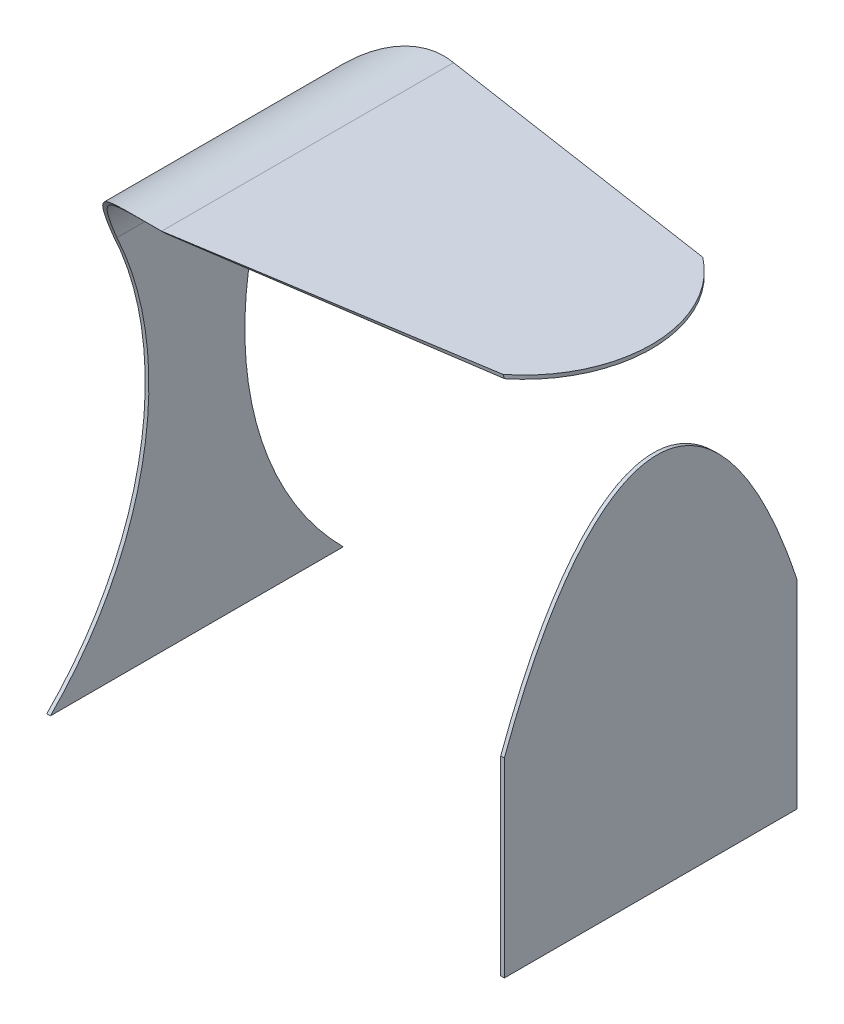
ISO-10303-21;
HEADER;
FILE_DESCRIPTION(('STEP AP214'),'2;1');
FILE_NAME('part.step','',(''),(''),'','','');
FILE_SCHEMA(('AUTOMOTIVE_DESIGN { 1 0 10303 214 1 1 1 1 }'));
ENDSEC;
DATA;
#1=APPLICATION_CONTEXT('core data for automotive mechanical design processes');
#2=APPLICATION_PROTOCOL_DEFINITION('international standard','automotive_design',2000,#1);
#3=PRODUCT_CONTEXT('',#1,'mechanical');
#4=PRODUCT('Part','Part','',(#3));
#5=PRODUCT_RELATED_PRODUCT_CATEGORY('part','',(#4));
#6=PRODUCT_DEFINITION_FORMATION('','',#4);
#7=PRODUCT_DEFINITION_CONTEXT('part definition',#1,'design');
#8=PRODUCT_DEFINITION('design','',#6,#7);
#9=PRODUCT_DEFINITION_SHAPE('','',#8);
#10=(LENGTH_UNIT() NAMED_UNIT(*) SI_UNIT(.MILLI.,.METRE.));
#11=(NAMED_UNIT(*) PLANE_ANGLE_UNIT() SI_UNIT($,.RADIAN.));
#12=(NAMED_UNIT(*) SI_UNIT($,.STERADIAN.) SOLID_ANGLE_UNIT());
#13=UNCERTAINTY_MEASURE_WITH_UNIT(LENGTH_MEASURE(1.E-05),#10,'distance_accuracy_value','');
#14=(GEOMETRIC_REPRESENTATION_CONTEXT(3) GLOBAL_UNCERTAINTY_ASSIGNED_CONTEXT((#13)) GLOBAL_UNIT_ASSIGNED_CONTEXT((#10,
#11,#12)) REPRESENTATION_CONTEXT('',''));
#15=CARTESIAN_POINT('',(0.,0.,0.));
#16=DIRECTION('',(0.,0.,1.));
#17=DIRECTION('',(1.,0.,0.));
#18=AXIS2_PLACEMENT_3D('',#15,#16,#17);
#19=CARTESIAN_POINT('',(62.5,149.317999385392,160.));
#20=DIRECTION('',(0.,1.,0.));
#21=DIRECTION('',(0.,0.,1.));
#22=AXIS2_PLACEMENT_3D('',#19,#20,#21);
#23=PLANE('',#22);
#24=DIRECTION('',(0.990439981737684,0.,0.13794434593508));
#25=VECTOR('',#24,1.);
#26=CARTESIAN_POINT('',(62.5,149.317999385392,2.23484410227831));
#27=LINE('',#26,#25);
#28=CARTESIAN_POINT('',(62.5,149.317999385392,2.23484410227833));
#29=VERTEX_POINT('',#28);
#30=CARTESIAN_POINT('',(223.057151966639,149.317999385392,24.5965739613451));
#31=VERTEX_POINT('',#30);
#32=EDGE_CURVE('E176',#29,#31,#27,.T.);
#33=ORIENTED_EDGE('',*,*,#32,.T.);
#34=CARTESIAN_POINT('',(180.394518772485,149.317999385392,79.594962536421));
#35=DIRECTION('',(0.,1.,0.));
#36=DIRECTION('',(0.,0.,1.));
#37=AXIS2_PLACEMENT_3D('',#34,#35,#36);
#38=CIRCLE('',#37,69.6054812275151);
#39=CARTESIAN_POINT('',(223.957622660805,149.317999385392,133.882889339066));
#40=VERTEX_POINT('',#39);
#41=EDGE_CURVE('E155',#31,#40,#38,.F.);
#42=ORIENTED_EDGE('',*,*,#41,.T.);
#43=DIRECTION('',(0.989236638860616,0.,-0.146324544543122));
#44=VECTOR('',#43,1.);
#45=CARTESIAN_POINT('',(62.5,149.317999385392,157.765155897722));
#46=LINE('',#45,#44);
#47=CARTESIAN_POINT('',(62.4999999999999,149.317999385392,157.765155897722));
#48=VERTEX_POINT('',#47);
#49=EDGE_CURVE('E154',#48,#40,#46,.T.);
#50=ORIENTED_EDGE('',*,*,#49,.F.);
#51=DIRECTION('',(-1.,0.,0.));
#52=VECTOR('',#51,1.);
#53=CARTESIAN_POINT('',(76.,149.317999385392,157.765155897722));
#54=LINE('',#53,#52);
#55=CARTESIAN_POINT('',(62.4011169263193,149.317999385392,157.765155897722));
#56=VERTEX_POINT('',#55);
#57=EDGE_CURVE('E426',#48,#56,#54,.T.);
#58=ORIENTED_EDGE('',*,*,#57,.T.);
#59=DIRECTION('',(0.,0.,-1.));
#60=VECTOR('',#59,1.);
#61=CARTESIAN_POINT('',(62.4011169263193,149.317999385392,160.));
#62=LINE('',#61,#60);
#63=CARTESIAN_POINT('',(62.4011169263193,149.317999385392,2.23484410227831));
#64=VERTEX_POINT('',#63);
#65=EDGE_CURVE('E75',#56,#64,#62,.T.);
#66=ORIENTED_EDGE('',*,*,#65,.T.);
#67=DIRECTION('',(-1.,0.,0.));
#68=VECTOR('',#67,1.);
#69=CARTESIAN_POINT('',(76.,149.317999385392,2.23484410227831));
#70=LINE('',#69,#68);
#71=EDGE_CURVE('E195',#64,#29,#70,.F.);
#72=ORIENTED_EDGE('',*,*,#71,.T.);
#73=EDGE_LOOP('',(#33,#42,#50,#58,#66,#72));
#74=FACE_BOUND('',#73,.T.);
#75=ADVANCED_FACE('F67',(#74),#23,.F.);
#76=CARTESIAN_POINT('',(56.9089996926959,94.4089996926958,160.));
#77=DIRECTION('',(0.,0.,-1.));
#78=DIRECTION('',(-1.,0.,0.));
#79=AXIS2_PLACEMENT_3D('',#76,#77,#78);
#80=CYLINDRICAL_SURFACE('',#79,57.1829828747989);
#81=CARTESIAN_POINT('',(0.,100.,36.2769439837703));
#82=CARTESIAN_POINT('',(0.0894251854068727,100.910264226733,35.8481222989774));
#83=CARTESIAN_POINT('',(0.20038439750584,101.815209377063,35.4126243680256));
#84=CARTESIAN_POINT('',(0.464264629507742,103.612829880475,34.5294126283633));
#85=CARTESIAN_POINT('',(0.617181375175093,104.505506473639,34.0817000681449));
#86=CARTESIAN_POINT('',(0.963778202873993,106.276577628818,33.1753978503101));
#87=CARTESIAN_POINT('',(1.15743214844426,107.154980960974,32.7168153333074));
#88=CARTESIAN_POINT('',(1.58446032737536,108.896685009406,31.7896781456877));
#89=CARTESIAN_POINT('',(1.81783560109671,109.759985329458,31.3211232141596));
#90=CARTESIAN_POINT('',(2.57512377051213,112.32246192989,29.9038407380351));
#91=CARTESIAN_POINT('',(3.15686350115074,113.997577255652,28.9417704710613));
#92=CARTESIAN_POINT('',(4.46670267422728,117.27412017853,26.9922783714379));
#93=CARTESIAN_POINT('',(5.19482654078709,118.875535423956,26.0048523322037));
#94=CARTESIAN_POINT('',(6.78868731824835,121.993512944733,24.0176126705739));
#95=CARTESIAN_POINT('',(7.65407040423251,123.510280192452,23.0178368326574));
#96=CARTESIAN_POINT('',(9.5183804602047,126.456816266627,21.0146388563287));
#97=CARTESIAN_POINT('',(10.5173083671136,127.886584482616,20.0112166923829));
#98=CARTESIAN_POINT('',(12.6456528965686,130.653995088677,18.0121576384153));
#99=CARTESIAN_POINT('',(13.7751832672922,131.991555527475,17.0165283536146));
#100=CARTESIAN_POINT('',(16.1613051319973,134.566177821368,15.0479869037206));
#101=CARTESIAN_POINT('',(17.4178773151221,135.80325489893,14.0750713136475));
#102=CARTESIAN_POINT('',(19.8442734347389,137.97860381102,12.3215726438583));
#103=CARTESIAN_POINT('',(20.9955564924802,138.932937102207,11.535218544389));
#104=CARTESIAN_POINT('',(23.3860107886592,140.759459219238,10.0011016639275));
#105=CARTESIAN_POINT('',(24.6251819472348,141.631648119722,9.25333884786942));
#106=CARTESIAN_POINT('',(27.1885138147579,143.285469154809,7.810606051576));
#107=CARTESIAN_POINT('',(28.5125410899475,144.067238293437,7.11555676493895));
#108=CARTESIAN_POINT('',(31.245321097724,145.533079426331,5.79214540756637));
#109=CARTESIAN_POINT('',(32.6540490882371,146.217179755654,5.16376400920993));
#110=CARTESIAN_POINT('',(35.2071497128231,147.327549756425,4.13039063471641));
#111=CARTESIAN_POINT('',(36.3346173497755,147.776428673294,3.70783078255361));
#112=CARTESIAN_POINT('',(38.6334891449857,148.606713506258,2.91940418263262));
#113=CARTESIAN_POINT('',(39.8048891145889,148.988125835122,2.55353204706047));
#114=CARTESIAN_POINT('',(42.1845877699965,149.67758306294,1.88745687123886));
#115=CARTESIAN_POINT('',(43.3928035484495,149.985780787572,1.58711714966811));
#116=CARTESIAN_POINT('',(45.8419471023371,150.524823561419,1.0590058964829));
#117=CARTESIAN_POINT('',(47.082871713143,150.755676064484,0.831227372164709));
#118=CARTESIAN_POINT('',(49.492518369071,151.121052360898,0.469463472853051));
#119=CARTESIAN_POINT('',(50.6594231399249,151.261634649216,0.329596951750967));
#120=CARTESIAN_POINT('',(52.4190625987311,151.418485021339,0.173285237970998));
#121=CARTESIAN_POINT('',(53.0072190520505,151.461766360894,0.130094266970799));
#122=CARTESIAN_POINT('',(54.1856190386543,151.530141426098,0.0618211681674154));
#123=CARTESIAN_POINT('',(54.7758623646014,151.555236910222,0.0367372895048355));
#124=CARTESIAN_POINT('',(55.9620080338463,151.587243448942,0.00474086077306249));
#125=CARTESIAN_POINT('',(56.5579181723858,151.594008907012,-0.00202619725791713));
#126=CARTESIAN_POINT('',(57.7495877895979,151.588908635785,0.00307378527230795));
#127=CARTESIAN_POINT('',(58.3453472666152,151.577042709973,0.0149410223790596));
#128=CARTESIAN_POINT('',(59.5357853479741,151.534723216569,0.0572381219575971));
#129=CARTESIAN_POINT('',(60.1304634122254,151.504262068121,0.0876755550782242));
#130=CARTESIAN_POINT('',(61.3173577825027,151.424910919956,0.166866887229138));
#131=CARTESIAN_POINT('',(61.9095741251778,151.376021195598,0.215620512580354));
#132=CARTESIAN_POINT('',(62.5,151.317999385392,0.273406356992732));
#133=B_SPLINE_CURVE_WITH_KNOTS('',3,(#81,#82,#83,#84,#85,#86,#87,#88,#89,#90,#91,#92,#93,#94,
#95,#96,#97,#98,#99,#100,#101,#102,#103,#104,#105,#106,#107,#108,#109,#110,#111,#112,#113,#114,
#115,#116,#117,#118,#119,#120,#121,#122,#123,#124,#125,#126,#127,#128,#129,#130,#131,#132),
.UNSPECIFIED.,.F.,.F.,(4,2,2,2,2,2,2,2,2,2,2,2,2,2,2,2,2,2,2,2,2,2,2,2,2,4),(0.,
3.03019720843583,6.06008584365336,9.08803643820011,12.1160663514719,18.1606500847009,
24.2062431920416,30.2364980242903,36.2667951656901,42.3023845256826,48.3370578276918,
53.4013696913797,58.4656769532971,63.522207364879,68.5772678138199,72.4289055623483,
76.2801770118699,80.1233373872937,83.9661272862303,87.5123954674664,89.285906060239,
91.0592451410028,92.8466292290993,94.6340321697867,96.4221642815815,98.2102696763128),.UNSPECIFIED.);
#134=CARTESIAN_POINT('',(0.,100.,36.2769439837703));
#135=VERTEX_POINT('',#134);
#136=CARTESIAN_POINT('',(62.5,151.317999385392,0.273406356992697));
#137=VERTEX_POINT('',#136);
#138=EDGE_CURVE('E212',#135,#137,#133,.T.);
#139=ORIENTED_EDGE('',*,*,#138,.F.);
#140=DIRECTION('',(0.,0.,-1.));
#141=VECTOR('',#140,1.);
#142=CARTESIAN_POINT('',(0.,100.,160.));
#143=LINE('',#142,#141);
#144=CARTESIAN_POINT('',(0.,100.,123.723056016229));
#145=VERTEX_POINT('',#144);
#146=EDGE_CURVE('E407',#145,#135,#143,.T.);
#147=ORIENTED_EDGE('',*,*,#146,.F.);
#148=CARTESIAN_POINT('',(62.5,151.317999385392,159.726593643007));
#149=CARTESIAN_POINT('',(61.8806714993802,151.378864153346,159.787212233017));
#150=CARTESIAN_POINT('',(61.2593710435809,151.42967743135,159.837887416205));
#151=CARTESIAN_POINT('',(60.0141220758025,151.511017922036,159.919070442771));
#152=CARTESIAN_POINT('',(59.3901735228355,151.54154481956,159.949577972835));
#153=CARTESIAN_POINT('',(58.1412296478481,151.582118266762,159.990133975472));
#154=CARTESIAN_POINT('',(57.516234936222,151.5921741912,160.000191813056));
#155=CARTESIAN_POINT('',(56.2662668746642,151.591785434822,159.999802677907));
#156=CARTESIAN_POINT('',(55.6412935245594,151.581341024574,159.989355975794));
#157=CARTESIAN_POINT('',(54.3982761284988,151.540191208729,159.948226125672));
#158=CARTESIAN_POINT('',(53.7802200351121,151.509667532006,159.917724487534));
#159=CARTESIAN_POINT('',(52.5466523023929,151.42869435456,159.83690429108));
#160=CARTESIAN_POINT('',(51.931140949399,151.378242670021,159.786583560886));
#161=CARTESIAN_POINT('',(50.7040039941897,151.257672213703,159.666520190951));
#162=CARTESIAN_POINT('',(50.0923780358672,151.187555271692,159.596779358172));
#163=CARTESIAN_POINT('',(48.874090869071,151.028002130949,159.43841026954));
#164=CARTESIAN_POINT('',(48.2674302097689,150.938563824422,159.349779953022));
#165=CARTESIAN_POINT('',(46.4585618994773,150.642194072052,159.056810051703));
#166=CARTESIAN_POINT('',(45.2651901867319,150.406981872289,158.825164961675));
#167=CARTESIAN_POINT('',(42.9101820244022,149.865177567725,158.295313569998));
#168=CARTESIAN_POINT('',(41.7485461377101,149.558584197767,157.997106088606));
#169=CARTESIAN_POINT('',(39.4598889494636,148.877800706904,157.340550749052));
#170=CARTESIAN_POINT('',(38.3329462532677,148.503468656189,156.982076731201));
#171=CARTESIAN_POINT('',(36.120228209177,147.6922969603,156.212883403343));
#172=CARTESIAN_POINT('',(35.0344577953536,147.255449853104,155.802157857056));
#173=CARTESIAN_POINT('',(32.4981381467246,146.14473797554,154.76935824211));
#174=CARTESIAN_POINT('',(31.0675602435629,145.444262193826,154.126677649739));
#175=CARTESIAN_POINT('',(28.294203048185,143.942581639506,152.773040596316));
#176=CARTESIAN_POINT('',(26.9514556095594,143.141340626774,152.062059592914));
#177=CARTESIAN_POINT('',(24.3540465700857,141.445974404449,150.586636093883));
#178=CARTESIAN_POINT('',(23.099511672822,140.551719985789,149.82211972457));
#179=CARTESIAN_POINT('',(20.6816030986934,138.678717235534,148.254202483527));
#180=CARTESIAN_POINT('',(19.5182223026425,137.699975515018,147.450804656403));
#181=CARTESIAN_POINT('',(17.2566383985745,135.639797320681,145.797342827606));
#182=CARTESIAN_POINT('',(16.1606342723959,134.556476351093,144.946624040276));
#183=CARTESIAN_POINT('',(14.0657747826488,132.312917307033,143.227417235392));
#184=CARTESIAN_POINT('',(13.0669177954007,131.152680518648,142.358929515115));
#185=CARTESIAN_POINT('',(11.1691272795526,128.761363671447,140.6146736353));
#186=CARTESIAN_POINT('',(10.2700773974295,127.530368698507,139.738915260153));
#187=CARTESIAN_POINT('',(8.57276894385432,125.000223053076,137.987306711701));
#188=CARTESIAN_POINT('',(7.77452825608772,123.70106034524,137.111456549617));
#189=CARTESIAN_POINT('',(6.55663252099459,121.528438909465,135.688121137345));
#190=CARTESIAN_POINT('',(6.10563911656148,120.673954525621,135.138227287447));
#191=CARTESIAN_POINT('',(5.24634447383642,118.940597192918,134.043342714373));
#192=CARTESIAN_POINT('',(4.83804492661482,118.061723279754,133.498352186194));
#193=CARTESIAN_POINT('',(4.06529764020418,116.280872825202,132.415097963893));
#194=CARTESIAN_POINT('',(3.70084944681181,115.378896523223,131.876834200148));
#195=CARTESIAN_POINT('',(3.01701852393659,113.553139966482,130.808730221623));
#196=CARTESIAN_POINT('',(2.69763507109617,112.629360061979,130.278889871757));
#197=CARTESIAN_POINT('',(2.10402634593898,110.757587727732,129.227121434082));
#198=CARTESIAN_POINT('',(1.82999170446656,109.809511515867,128.705234722277));
#199=CARTESIAN_POINT('',(1.33009011841822,107.894460288203,127.673241727206));
#200=CARTESIAN_POINT('',(1.10422169767586,106.927485852576,127.16313508334));
#201=CARTESIAN_POINT('',(0.701975337762239,104.975795779433,126.155941082135));
#202=CARTESIAN_POINT('',(0.52562820139157,103.991069503481,125.658862001584));
#203=CARTESIAN_POINT('',(0.224073560582761,102.00640002741,124.67948234791));
#204=CARTESIAN_POINT('',(0.0988727758837013,101.006454845681,124.197183724377));
#205=CARTESIAN_POINT('',(0.,100.,123.72305601623));
#206=B_SPLINE_CURVE_WITH_KNOTS('',3,(#148,#149,#150,#151,#152,#153,#154,#155,#156,#157,#158,
#159,#160,#161,#162,#163,#164,#165,#166,#167,#168,#169,#170,#171,#172,#173,#174,#175,#176,#177,
#178,#179,#180,#181,#182,#183,#184,#185,#186,#187,#188,#189,#190,#191,#192,#193,#194,#195,#196,
#197,#198,#199,#200,#201,#202,#203,#204,#205),.UNSPECIFIED.,.F.,.F.,(4,2,2,2,2,2,2,2,2,2,2,2,2,
2,2,2,2,2,2,2,2,2,2,2,2,2,2,2,4),(0.,1.87562637823221,3.75128189444614,5.62607825372364,
7.50084986937738,9.35888295642633,11.2171197131257,13.075183626237,14.9334503405955,
18.643107365741,22.3528301456792,26.0704176862959,29.7884493422685,34.93375353632,
40.0809135551081,45.2353217151496,50.3893269109487,55.6655167785964,60.941618446893,
66.2115032567017,71.4823216417516,74.8165076438357,78.1508256604381,81.4851091378855,
84.8193390889273,88.1672473012788,91.5150528944063,94.8649362712754,98.2152596229921),.UNSPECIFIED.);
#207=CARTESIAN_POINT('',(62.5,151.317999385392,159.726593643007));
#208=VERTEX_POINT('',#207);
#209=EDGE_CURVE('E220',#208,#145,#206,.T.);
#210=ORIENTED_EDGE('',*,*,#209,.F.);
#211=DIRECTION('',(0.,0.,-1.));
#212=VECTOR('',#211,1.);
#213=CARTESIAN_POINT('',(62.5,151.317999385392,160.));
#214=LINE('',#213,#212);
#215=EDGE_CURVE('E413',#208,#137,#214,.T.);
#216=ORIENTED_EDGE('',*,*,#215,.T.);
#217=EDGE_LOOP('',(#139,#147,#210,#216));
#218=FACE_BOUND('',#217,.T.);
#219=ADVANCED_FACE('F227',(#218),#80,.T.);
#220=CARTESIAN_POINT('',(0.,-58.1363431759144,160.));
#221=DIRECTION('',(-1.,0.,0.));
#222=DIRECTION('',(0.,-1.,0.));
#223=AXIS2_PLACEMENT_3D('',#220,#221,#222);
#224=PLANE('',#223);
#225=CARTESIAN_POINT('',(0.,21.7278196957901,-129.864162871706));
#226=DIRECTION('',(-1.,0.,0.));
#227=DIRECTION('',(0.,-1.,0.));
#228=AXIS2_PLACEMENT_3D('',#225,#226,#227);
#229=CIRCLE('',#228,183.655660399394);
#230=CARTESIAN_POINT('',(0.,-108.136343175914,0.));
#231=VERTEX_POINT('',#230);
#232=EDGE_CURVE('E162',#231,#135,#229,.T.);
#233=ORIENTED_EDGE('',*,*,#232,.F.);
#234=DIRECTION('',(0.,0.,-1.));
#235=VECTOR('',#234,1.);
#236=CARTESIAN_POINT('',(0.,-108.136343175914,160.));
#237=LINE('',#236,#235);
#238=CARTESIAN_POINT('',(0.,-108.136343175914,160.));
#239=VERTEX_POINT('',#238);
#240=EDGE_CURVE('E409',#239,#231,#237,.T.);
#241=ORIENTED_EDGE('',*,*,#240,.F.);
#242=CARTESIAN_POINT('',(0.,21.7278196957901,289.864162871705));
#243=DIRECTION('',(-1.,0.,0.));
#244=DIRECTION('',(0.,-1.,0.));
#245=AXIS2_PLACEMENT_3D('',#242,#243,#244);
#246=CIRCLE('',#245,183.655660399394);
#247=EDGE_CURVE('E219',#145,#239,#246,.T.);
#248=ORIENTED_EDGE('',*,*,#247,.F.);
#249=ORIENTED_EDGE('',*,*,#146,.T.);
#250=EDGE_LOOP('',(#233,#241,#248,#249));
#251=FACE_BOUND('',#250,.T.);
#252=ADVANCED_FACE('F231',(#251),#224,.T.);
#253=CARTESIAN_POINT('',(2.,-108.136343175914,160.));
#254=DIRECTION('',(0.,-1.,0.));
#255=DIRECTION('',(0.,0.,-1.));
#256=AXIS2_PLACEMENT_3D('',#253,#254,#255);
#257=PLANE('',#256);
#258=DIRECTION('',(-1.,0.,0.));
#259=VECTOR('',#258,1.);
#260=CARTESIAN_POINT('',(2.,-108.136343175914,0.));
#261=LINE('',#260,#259);
#262=CARTESIAN_POINT('',(2.,-108.136343175914,0.));
#263=VERTEX_POINT('',#262);
#264=EDGE_CURVE('E403',#263,#231,#261,.T.);
#265=ORIENTED_EDGE('',*,*,#264,.F.);
#266=DIRECTION('',(0.,0.,-1.));
#267=VECTOR('',#266,1.);
#268=CARTESIAN_POINT('',(2.,-108.136343175914,160.));
#269=LINE('',#268,#267);
#270=CARTESIAN_POINT('',(2.,-108.136343175914,160.));
#271=VERTEX_POINT('',#270);
#272=EDGE_CURVE('E420',#271,#263,#269,.T.);
#273=ORIENTED_EDGE('',*,*,#272,.F.);
#274=DIRECTION('',(-1.,0.,0.));
#275=VECTOR('',#274,1.);
#276=CARTESIAN_POINT('',(2.,-108.136343175914,160.));
#277=LINE('',#276,#275);
#278=EDGE_CURVE('E412',#271,#239,#277,.T.);
#279=ORIENTED_EDGE('',*,*,#278,.T.);
#280=ORIENTED_EDGE('',*,*,#240,.T.);
#281=EDGE_LOOP('',(#265,#273,#279,#280));
#282=FACE_BOUND('',#281,.T.);
#283=ADVANCED_FACE('F236',(#282),#257,.T.);
#284=CARTESIAN_POINT('',(2.,0.,160.));
#285=DIRECTION('',(-1.,0.,0.));
#286=DIRECTION('',(0.,0.,1.));
#287=AXIS2_PLACEMENT_3D('',#284,#285,#286);
#288=PLANE('',#287);
#289=ORIENTED_EDGE('',*,*,#272,.T.);
#290=CARTESIAN_POINT('',(2.,21.7278196957901,-129.864162871706));
#291=DIRECTION('',(-1.,0.,0.));
#292=DIRECTION('',(0.,0.,1.));
#293=AXIS2_PLACEMENT_3D('',#290,#291,#292);
#294=CIRCLE('',#293,183.655660399394);
#295=CARTESIAN_POINT('',(2.,99.9011169263194,36.3234937001491));
#296=VERTEX_POINT('',#295);
#297=EDGE_CURVE('E194',#263,#296,#294,.T.);
#298=ORIENTED_EDGE('',*,*,#297,.T.);
#299=DIRECTION('',(0.,0.,-1.));
#300=VECTOR('',#299,1.);
#301=CARTESIAN_POINT('',(2.,99.9011169263194,160.));
#302=LINE('',#301,#300);
#303=CARTESIAN_POINT('',(2.,99.9011169263194,123.676506299851));
#304=VERTEX_POINT('',#303);
#305=EDGE_CURVE('E422',#304,#296,#302,.T.);
#306=ORIENTED_EDGE('',*,*,#305,.F.);
#307=CARTESIAN_POINT('',(2.,21.7278196957901,289.864162871705));
#308=DIRECTION('',(-1.,0.,0.));
#309=DIRECTION('',(0.,0.,1.));
#310=AXIS2_PLACEMENT_3D('',#307,#308,#309);
#311=CIRCLE('',#310,183.655660399394);
#312=EDGE_CURVE('E404',#304,#271,#311,.T.);
#313=ORIENTED_EDGE('',*,*,#312,.T.);
#314=EDGE_LOOP('',(#289,#298,#306,#313));
#315=FACE_BOUND('',#314,.T.);
#316=ADVANCED_FACE('F239',(#315),#288,.F.);
#317=CARTESIAN_POINT('',(56.9089996926959,94.4089996926958,160.));
#318=DIRECTION('',(0.,0.,-1.));
#319=DIRECTION('',(-1.,0.,0.));
#320=AXIS2_PLACEMENT_3D('',#317,#318,#319);
#321=CYLINDRICAL_SURFACE('',#320,55.1829828747989);
#322=ORIENTED_EDGE('',*,*,#305,.T.);
#323=CARTESIAN_POINT('',(2.,99.9011169263194,36.3234937001491));
#324=CARTESIAN_POINT('',(2.08776270664048,100.77857942684,35.9107619479229));
#325=CARTESIAN_POINT('',(2.19627178227054,101.651015179136,35.491869521137));
#326=CARTESIAN_POINT('',(2.45375598071227,103.384270283935,34.6428435298806));
#327=CARTESIAN_POINT('',(2.6027272031747,104.245090747703,34.212711052505));
#328=CARTESIAN_POINT('',(2.9400257649269,105.953212877621,33.3424646384362));
#329=CARTESIAN_POINT('',(3.12832959512591,106.800522295174,32.9023568034636));
#330=CARTESIAN_POINT('',(3.54332320722944,108.48078772511,32.0130380145574));
#331=CARTESIAN_POINT('',(3.77001394333846,109.313743380126,31.5638268345814));
#332=CARTESIAN_POINT('',(4.50558402804599,111.787135350467,30.2053639331756));
#333=CARTESIAN_POINT('',(5.07046963479487,113.404648604226,29.2839798455477));
#334=CARTESIAN_POINT('',(6.34224854611239,116.569210365313,27.4186665885624));
#335=CARTESIAN_POINT('',(7.04916390952055,118.116247881112,26.4747339372463));
#336=CARTESIAN_POINT('',(8.59694655440724,121.129190839341,24.5765421038216));
#337=CARTESIAN_POINT('',(9.43749887344614,122.595276391067,23.6223120015909));
#338=CARTESIAN_POINT('',(11.2486869123613,125.443595087714,21.712155030103));
#339=CARTESIAN_POINT('',(12.2193241630528,126.825827245584,20.7562281410089));
#340=CARTESIAN_POINT('',(14.2876276235434,129.500892797241,18.8538990592283));
#341=CARTESIAN_POINT('',(15.3853833446009,130.79366215927,17.9075040945059));
#342=CARTESIAN_POINT('',(17.7046901266294,133.281551987424,16.0384959419363));
#343=CARTESIAN_POINT('',(18.9262212568572,134.476688118986,15.1158789551937));
#344=CARTESIAN_POINT('',(21.2777736417309,136.570907501137,13.4604364272233));
#345=CARTESIAN_POINT('',(22.3891847095356,137.486157191078,12.7215812938164));
#346=CARTESIAN_POINT('',(24.6961184457154,139.237437293371,11.281775215332));
#347=CARTESIAN_POINT('',(25.8916401686272,140.073468595945,10.5808238443458));
#348=CARTESIAN_POINT('',(28.3637041023553,141.658127836178,9.2300689220692));
#349=CARTESIAN_POINT('',(29.6401209537326,142.406886140107,8.58018956631307));
#350=CARTESIAN_POINT('',(32.2732836305953,143.810083645912,7.34442382227035));
#351=CARTESIAN_POINT('',(33.6300074699286,144.464548496141,6.75852004280318));
#352=CARTESIAN_POINT('',(36.1024373823559,145.532645052924,5.79040677472421));
#353=CARTESIAN_POINT('',(37.202856559081,145.967208830938,5.39216424590954));
#354=CARTESIAN_POINT('',(39.4459469722942,146.769495682599,4.65081493135444));
#355=CARTESIAN_POINT('',(40.5886143561782,147.137224832877,4.3077031334346));
#356=CARTESIAN_POINT('',(42.9092322074397,147.800210729275,3.68493141819888));
#357=CARTESIAN_POINT('',(44.0871100679494,148.095606432298,3.40514991903991));
#358=CARTESIAN_POINT('',(46.4737343051646,148.610071289128,2.91543802223552));
#359=CARTESIAN_POINT('',(47.6824773397439,148.829148669495,2.70550009607128));
#360=CARTESIAN_POINT('',(50.0067324192197,149.169994222586,2.37782760663773));
#361=CARTESIAN_POINT('',(51.1202206945146,149.299018059362,2.2532392530706));
#362=CARTESIAN_POINT('',(53.3584898632373,149.489086719185,2.06944997276276));
#363=CARTESIAN_POINT('',(54.4832698660663,149.550136861591,2.01024392945706));
#364=CARTESIAN_POINT('',(56.176440550569,149.590041036687,1.97154476463139));
#365=CARTESIAN_POINT('',(56.7438694667896,149.594653404352,1.96707154462042));
#366=CARTESIAN_POINT('',(57.8785240407402,149.586380308366,1.97509610527297));
#367=CARTESIAN_POINT('',(58.4457496965583,149.57349468424,1.98759404158093));
#368=CARTESIAN_POINT('',(59.5791007261909,149.530264435608,2.02949774186171));
#369=CARTESIAN_POINT('',(60.1452256333636,149.499913561934,2.05890955771761));
#370=CARTESIAN_POINT('',(61.2751583150452,149.421901128775,2.13441910622078));
#371=CARTESIAN_POINT('',(61.8389661224236,149.374239815716,2.18051660133797));
#372=CARTESIAN_POINT('',(62.4011169263193,149.317999385392,2.23484410227832));
#373=B_SPLINE_CURVE_WITH_KNOTS('',3,(#323,#324,#325,#326,#327,#328,#329,#330,#331,#332,#333,
#334,#335,#336,#337,#338,#339,#340,#341,#342,#343,#344,#345,#346,#347,#348,#349,#350,#351,#352,
#353,#354,#355,#356,#357,#358,#359,#360,#361,#362,#363,#364,#365,#366,#367,#368,#369,#370,#371,
#372),.UNSPECIFIED.,.F.,.F.,(4,2,2,2,2,2,2,2,2,2,2,2,2,2,2,2,2,2,2,2,2,2,2,2,4),(0.,
2.92061566263823,5.84094989234075,8.75954360814758,11.6782098837017,17.5068406823742,
23.3363774345768,29.1523731335015,34.968437279987,40.7886220372802,46.6078710931942,
51.4585292318701,56.309132854417,61.1523952964039,65.9943378462856,69.7360329006243,
73.4773875881492,77.2114975062855,80.9452047899218,84.3249828417043,87.7044963864712,
89.4064613010387,91.108441824631,92.8110317058535,94.5135973506992),.UNSPECIFIED.);
#374=EDGE_CURVE('E186',#296,#64,#373,.T.);
#375=ORIENTED_EDGE('',*,*,#374,.T.);
#376=ORIENTED_EDGE('',*,*,#65,.F.);
#377=CARTESIAN_POINT('',(62.4011169263193,149.317999385392,157.765155897722));
#378=CARTESIAN_POINT('',(61.7983188312163,149.378310747659,157.823417767936));
#379=CARTESIAN_POINT('',(61.1936076955854,149.428751942799,157.872208460673));
#380=CARTESIAN_POINT('',(59.981605151513,149.509716956234,157.95058453657));
#381=CARTESIAN_POINT('',(59.3743137040654,149.540240472351,157.980169628354));
#382=CARTESIAN_POINT('',(58.1586749551777,149.581182479521,158.019861266748));
#383=CARTESIAN_POINT('',(57.550328216998,149.59160957132,158.029976146098));
#384=CARTESIAN_POINT('',(56.3336194055757,149.59233586027,158.030680216161));
#385=CARTESIAN_POINT('',(55.7252573326241,149.582635311883,158.021269653724));
#386=CARTESIAN_POINT('',(54.5149880592996,149.543324343784,157.98315932769));
#387=CARTESIAN_POINT('',(53.9130700878184,149.513884583684,157.95462490447));
#388=CARTESIAN_POINT('',(52.7116493579351,149.435414256312,157.878652820585));
#389=CARTESIAN_POINT('',(52.1121468682738,149.386381566829,157.831213112192));
#390=CARTESIAN_POINT('',(50.9168543656196,149.268969911291,157.717792210612));
#391=CARTESIAN_POINT('',(50.321064004504,149.200592788136,157.651812783664));
#392=CARTESIAN_POINT('',(49.1342406884556,149.04482270976,157.501804458303));
#393=CARTESIAN_POINT('',(48.5432082541156,148.957427702234,157.417773611895));
#394=CARTESIAN_POINT('',(46.7806562559149,148.667580555323,157.139745073547));
#395=CARTESIAN_POINT('',(45.6176266172412,148.437262542751,156.9196132096));
#396=CARTESIAN_POINT('',(43.3222142409553,147.906192545799,156.415471142486));
#397=CARTESIAN_POINT('',(42.1898320016028,147.605439417065,156.131459901478));
#398=CARTESIAN_POINT('',(39.9587584820723,146.93717839046,155.505583520449));
#399=CARTESIAN_POINT('',(38.8601394931315,146.569537534908,155.163603245273));
#400=CARTESIAN_POINT('',(36.703003151977,145.772431692107,154.429198717919));
#401=CARTESIAN_POINT('',(35.6444905824713,145.342959360554,154.036768473918));
#402=CARTESIAN_POINT('',(33.1884537358026,144.257802176729,153.055836118171));
#403=CARTESIAN_POINT('',(31.8095357171021,143.57703495205,152.448327101817));
#404=CARTESIAN_POINT('',(29.1360273279253,142.117957947546,151.168242283657));
#405=CARTESIAN_POINT('',(27.8414661514995,141.339614668413,150.495644153964));
#406=CARTESIAN_POINT('',(25.3373627928296,139.693011582131,149.0991746615));
#407=CARTESIAN_POINT('',(24.1279387006932,138.824630858858,148.375234772161));
#408=CARTESIAN_POINT('',(21.7973116531432,137.006132100551,146.889721916601));
#409=CARTESIAN_POINT('',(20.6761022075816,136.056020089456,146.12815172565));
#410=CARTESIAN_POINT('',(18.4992892376116,134.058525838326,144.561513599858));
#411=CARTESIAN_POINT('',(17.4456356070955,133.009481076829,143.755860537275));
#412=CARTESIAN_POINT('',(15.4323777751249,130.837613076367,142.126905336628));
#413=CARTESIAN_POINT('',(14.4727721139087,129.714790982985,141.30360347274));
#414=CARTESIAN_POINT('',(12.6502717871038,127.401313001404,139.649200752229));
#415=CARTESIAN_POINT('',(11.7872733729789,126.210731995165,138.818109321333));
#416=CARTESIAN_POINT('',(10.1589416828946,123.764618868919,137.155026902444));
#417=CARTESIAN_POINT('',(9.39362459272837,122.509076033052,136.323035788347));
#418=CARTESIAN_POINT('',(8.23131861698205,120.41848500955,134.975582264366));
#419=CARTESIAN_POINT('',(7.80358475330415,119.601691179053,134.458054188366));
#420=CARTESIAN_POINT('',(6.98861925805771,117.945542208083,133.427266940119));
#421=CARTESIAN_POINT('',(6.60138484267086,117.106188623296,132.914007476694));
#422=CARTESIAN_POINT('',(5.86837065798832,115.405973499655,131.893316109504));
#423=CARTESIAN_POINT('',(5.52259535520006,114.545109655491,131.385884838942));
#424=CARTESIAN_POINT('',(4.87367768136604,112.80330518172,130.37852231326));
#425=CARTESIAN_POINT('',(4.57052999479241,111.922367071259,129.878590129986));
#426=CARTESIAN_POINT('',(4.00693854180692,110.13833188324,128.885813809766));
#427=CARTESIAN_POINT('',(3.74665926376097,109.235164068136,128.393003303929));
#428=CARTESIAN_POINT('',(3.27144990777363,107.411414981933,127.417887269421));
#429=CARTESIAN_POINT('',(3.05651857169751,106.490834194712,126.93558144964));
#430=CARTESIAN_POINT('',(2.67319036224626,104.633394439489,125.982630362343));
#431=CARTESIAN_POINT('',(2.50481913222351,103.696526802061,125.511991649957));
#432=CARTESIAN_POINT('',(2.21607085105419,101.808806583132,124.583958462446));
#433=CARTESIAN_POINT('',(2.09569952218922,100.85795234823,124.126565572439));
#434=CARTESIAN_POINT('',(2.,99.9011169263194,123.676506299851));
#435=B_SPLINE_CURVE_WITH_KNOTS('',3,(#377,#378,#379,#380,#381,#382,#383,#384,#385,#386,#387,
#388,#389,#390,#391,#392,#393,#394,#395,#396,#397,#398,#399,#400,#401,#402,#403,#404,#405,#406,
#407,#408,#409,#410,#411,#412,#413,#414,#415,#416,#417,#418,#419,#420,#421,#422,#423,#424,#425,
#426,#427,#428,#429,#430,#431,#432,#433,#434),.UNSPECIFIED.,.F.,.F.,(4,2,2,2,2,2,2,2,2,2,2,2,2,
2,2,2,2,2,2,2,2,2,2,2,2,2,2,2,4),(0.,1.82566750784552,3.65136271285647,5.47627639432983,
7.30116700462391,9.11048015443028,10.9199893335385,12.7293261828763,14.538858382668,
18.1517193531458,21.7646390256047,25.3848204277701,29.0054321880723,33.9585488668829,
38.9133707051765,43.8749350103257,48.8361339401343,53.9049161573981,58.9736196873016,
64.0368265246676,69.1008712491175,72.2719494145425,75.4428094655074,78.61401081584,
81.7848163761353,84.9675184953865,88.1501323020362,91.3344954834655,94.5192381735758),.UNSPECIFIED.);
#436=EDGE_CURVE('E428',#56,#304,#435,.T.);
#437=ORIENTED_EDGE('',*,*,#436,.T.);
#438=EDGE_LOOP('',(#322,#375,#376,#437));
#439=FACE_BOUND('',#438,.T.);
#440=ADVANCED_FACE('F197',(#439),#321,.F.);
#441=CARTESIAN_POINT('',(76.,21.7278196957901,289.864162871705));
#442=DIRECTION('',(-1.,0.,0.));
#443=DIRECTION('',(0.,-1.,0.));
#444=AXIS2_PLACEMENT_3D('',#441,#442,#443);
#445=CYLINDRICAL_SURFACE('',#444,183.655660399394);
#446=ORIENTED_EDGE('',*,*,#209,.T.);
#447=ORIENTED_EDGE('',*,*,#247,.T.);
#448=ORIENTED_EDGE('',*,*,#278,.F.);
#449=ORIENTED_EDGE('',*,*,#312,.F.);
#450=ORIENTED_EDGE('',*,*,#436,.F.);
#451=ORIENTED_EDGE('',*,*,#57,.F.);
#452=CARTESIAN_POINT('',(62.5,21.7278196957901,289.864162871705));
#453=DIRECTION('',(-1.,0.,0.));
#454=DIRECTION('',(0.,-1.,0.));
#455=AXIS2_PLACEMENT_3D('',#452,#453,#454);
#456=CIRCLE('',#455,183.655660399394);
#457=EDGE_CURVE('E400',#208,#48,#456,.T.);
#458=ORIENTED_EDGE('',*,*,#457,.F.);
#459=EDGE_LOOP('',(#446,#447,#448,#449,#450,#451,#458));
#460=FACE_BOUND('',#459,.T.);
#461=ADVANCED_FACE('F205',(#460),#445,.F.);
#462=CARTESIAN_POINT('',(76.,21.7278196957901,-129.864162871706));
#463=DIRECTION('',(-1.,0.,0.));
#464=DIRECTION('',(0.,-1.,0.));
#465=AXIS2_PLACEMENT_3D('',#462,#463,#464);
#466=CYLINDRICAL_SURFACE('',#465,183.655660399394);
#467=ORIENTED_EDGE('',*,*,#138,.T.);
#468=CARTESIAN_POINT('',(62.5,21.7278196957901,-129.864162871706));
#469=DIRECTION('',(-1.,0.,0.));
#470=DIRECTION('',(0.,-1.,0.));
#471=AXIS2_PLACEMENT_3D('',#468,#469,#470);
#472=CIRCLE('',#471,183.655660399394);
#473=EDGE_CURVE('E168',#29,#137,#472,.T.);
#474=ORIENTED_EDGE('',*,*,#473,.F.);
#475=ORIENTED_EDGE('',*,*,#71,.F.);
#476=ORIENTED_EDGE('',*,*,#374,.F.);
#477=ORIENTED_EDGE('',*,*,#297,.F.);
#478=ORIENTED_EDGE('',*,*,#264,.T.);
#479=ORIENTED_EDGE('',*,*,#232,.T.);
#480=EDGE_LOOP('',(#467,#474,#475,#476,#477,#478,#479));
#481=FACE_BOUND('',#480,.T.);
#482=ADVANCED_FACE('F200',(#481),#466,.F.);
#483=CARTESIAN_POINT('',(62.5,151.317999385392,159.726593643007));
#484=CARTESIAN_POINT('',(250.,151.317999385392,130.030788786698));
#485=CARTESIAN_POINT('',(62.5,150.987168890144,159.397154699434));
#486=CARTESIAN_POINT('',(250.,150.984666052058,130.030788786698));
#487=CARTESIAN_POINT('',(62.5,150.655077281848,159.068972575112));
#488=CARTESIAN_POINT('',(250.,150.651332718725,130.030788786698));
#489=CARTESIAN_POINT('',(62.5,149.988400921176,158.415150486256));
#490=CARTESIAN_POINT('',(250.,149.984666052058,130.030788786698));
#491=CARTESIAN_POINT('',(62.5,149.6538161688,158.089510521722));
#492=CARTESIAN_POINT('',(250.,149.651332718725,130.030788786698));
#493=CARTESIAN_POINT('',(62.5,149.317999385392,157.765155897722));
#494=CARTESIAN_POINT('',(250.,149.317999385392,130.030788786698));
#495=B_SPLINE_SURFACE_WITH_KNOTS('',3,1,((#483,#484),(#485,#486),(#487,#488),(#489,#490),(#491,
#492),(#493,#494)),.UNSPECIFIED.,.F.,.F.,.F.,(4,2,4),(2,2),(0.,0.5,1.),(0.,1.),.UNSPECIFIED.);
#496=CARTESIAN_POINT('',(223.530376007304,151.317999385392,134.222984993136));
#497=CARTESIAN_POINT('',(223.580090058462,151.093310127681,134.18372916222));
#498=CARTESIAN_POINT('',(223.629244315144,150.868439320524,134.144805529312));
#499=CARTESIAN_POINT('',(223.725503157831,150.422820517848,134.068373639029));
#500=CARTESIAN_POINT('',(223.772629062475,150.202079316152,134.030852623982));
#501=CARTESIAN_POINT('',(223.86587349697,149.760275052079,133.956418438342));
#502=CARTESIAN_POINT('',(223.911991997851,149.539211980641,133.919505285237));
#503=CARTESIAN_POINT('',(223.957622660805,149.317999385392,133.882889339066));
#504=B_SPLINE_CURVE_WITH_KNOTS('',3,(#496,#497,#498,#499,#500,#501,#502,#503),.UNSPECIFIED.,.F.,
.F.,(4,2,2,4),(0.,0.700341205782451,1.38677663445182,2.07323177615529),.UNSPECIFIED.);
#505=CARTESIAN_POINT('',(223.530376007304,151.317999385392,134.222984993135));
#506=VERTEX_POINT('',#505);
#507=EDGE_CURVE('E143',#506,#40,#504,.T.);
#508=DIRECTION('',(0.987689380498075,0.,-0.156427899210239));
#509=VECTOR('',#508,1.);
#510=CARTESIAN_POINT('',(62.5,151.317999385392,159.726593643007));
#511=LINE('',#510,#509);
#512=CARTESIAN_POINT('',(156.25,151.317999385392,144.878691214853));
#513=VERTEX_POINT('',#512);
#514=EDGE_CURVE('E150',#513,#506,#511,.T.);
#515=EDGE_CURVE('E159',#208,#513,#511,.T.);
#516=ORIENTED_EDGE('',*,*,#507,.F.);
#517=ORIENTED_EDGE('',*,*,#514,.F.);
#518=ORIENTED_EDGE('',*,*,#515,.F.);
#519=ORIENTED_EDGE('',*,*,#457,.T.);
#520=ORIENTED_EDGE('',*,*,#49,.T.);
#521=EDGE_LOOP('',(#516,#517,#518,#519,#520));
#522=FACE_BOUND('',#521,.T.);
#523=ADVANCED_FACE('F148',(#522),#495,.T.);
#524=CARTESIAN_POINT('',(62.5,149.317999385392,2.23484410227831));
#525=CARTESIAN_POINT('',(250.,149.317999385392,28.349061358986));
#526=CARTESIAN_POINT('',(62.5,149.6538161688,1.91048947827837));
#527=CARTESIAN_POINT('',(250.,149.651332718725,28.349061358986));
#528=CARTESIAN_POINT('',(62.5,149.988400921176,1.58484951374376));
#529=CARTESIAN_POINT('',(250.,149.984666052059,28.349061358986));
#530=CARTESIAN_POINT('',(62.5,150.655077281848,0.931027424887722));
#531=CARTESIAN_POINT('',(250.,150.651332718725,28.349061358986));
#532=CARTESIAN_POINT('',(62.5,150.987168890144,0.602845300566292));
#533=CARTESIAN_POINT('',(250.,150.984666052058,28.349061358986));
#534=CARTESIAN_POINT('',(62.5,151.317999385392,0.273406356992717));
#535=CARTESIAN_POINT('',(250.,151.317999385392,28.349061358986));
#536=B_SPLINE_SURFACE_WITH_KNOTS('',3,1,((#524,#525),(#526,#527),(#528,#529),(#530,#531),(#532,
#533),(#534,#535)),.UNSPECIFIED.,.F.,.F.,.F.,(4,2,4),(2,2),(0.,0.5,1.),(0.,1.),.UNSPECIFIED.);
#537=CARTESIAN_POINT('',(223.057151966639,149.317999385392,24.5965739613451));
#538=CARTESIAN_POINT('',(223.007786537101,149.542931140154,24.5582810629773));
#539=CARTESIAN_POINT('',(222.95787252159,149.76768848718,24.519668695565));
#540=CARTESIAN_POINT('',(222.857638829703,150.213585098648,24.4423523767548));
#541=CARTESIAN_POINT('',(222.807335470327,150.434729663018,24.403657832685));
#542=CARTESIAN_POINT('',(222.705586387746,150.876648797465,24.3256158997125));
#543=CARTESIAN_POINT('',(222.65414062472,151.097423354355,24.2862684880642));
#544=CARTESIAN_POINT('',(222.602105929199,151.317999385392,24.2465876431834));
#545=B_SPLINE_CURVE_WITH_KNOTS('',3,(#537,#538,#539,#540,#541,#542,#543,#544),.UNSPECIFIED.,.F.,
.F.,(4,2,2,4),(0.,0.70034118081426,1.39054992181903,2.08078275993645),.UNSPECIFIED.);
#546=CARTESIAN_POINT('',(222.602105929199,151.317999385392,24.2465876431834));
#547=VERTEX_POINT('',#546);
#548=EDGE_CURVE('E82',#31,#547,#545,.T.);
#549=DIRECTION('',(0.988974501777742,0.,0.14808590356096));
#550=VECTOR('',#549,1.);
#551=CARTESIAN_POINT('',(156.25,151.317999385392,14.3112338579893));
#552=LINE('',#551,#550);
#553=CARTESIAN_POINT('',(156.25,151.317999385392,14.3112338579893));
#554=VERTEX_POINT('',#553);
#555=EDGE_CURVE('E160',#137,#554,#552,.T.);
#556=EDGE_CURVE('E88',#554,#547,#552,.T.);
#557=ORIENTED_EDGE('',*,*,#548,.F.);
#558=ORIENTED_EDGE('',*,*,#32,.F.);
#559=ORIENTED_EDGE('',*,*,#473,.T.);
#560=ORIENTED_EDGE('',*,*,#555,.T.);
#561=ORIENTED_EDGE('',*,*,#556,.T.);
#562=EDGE_LOOP('',(#557,#558,#559,#560,#561));
#563=FACE_BOUND('',#562,.T.);
#564=ADVANCED_FACE('F257',(#563),#536,.T.);
#565=CARTESIAN_POINT('',(0.,151.317999385392,0.));
#566=DIRECTION('',(0.,-1.,0.));
#567=DIRECTION('',(0.,0.,-1.));
#568=AXIS2_PLACEMENT_3D('',#565,#566,#567);
#569=PLANE('',#568);
#570=ORIENTED_EDGE('',*,*,#514,.T.);
#571=CARTESIAN_POINT('',(180.394518772485,151.317999385392,79.594962536421));
#572=DIRECTION('',(0.,-1.,0.));
#573=DIRECTION('',(0.,0.,-1.));
#574=AXIS2_PLACEMENT_3D('',#571,#572,#573);
#575=CIRCLE('',#574,69.6054812275151);
#576=EDGE_CURVE('E13',#506,#547,#575,.F.);
#577=ORIENTED_EDGE('',*,*,#576,.T.);
#578=ORIENTED_EDGE('',*,*,#556,.F.);
#579=ORIENTED_EDGE('',*,*,#555,.F.);
#580=ORIENTED_EDGE('',*,*,#215,.F.);
#581=ORIENTED_EDGE('',*,*,#515,.T.);
#582=EDGE_LOOP('',(#570,#577,#578,#579,#580,#581));
#583=FACE_BOUND('',#582,.T.);
#584=ADVANCED_FACE('F157',(#583),#569,.F.);
#585=CARTESIAN_POINT('',(180.394518772485,123.317999385392,79.594962536421));
#586=DIRECTION('',(0.,1.,0.));
#587=DIRECTION('',(0.,0.,1.));
#588=AXIS2_PLACEMENT_3D('',#585,#586,#587);
#589=CYLINDRICAL_SURFACE('',#588,69.6054812275151);
#590=ORIENTED_EDGE('',*,*,#41,.F.);
#591=ORIENTED_EDGE('',*,*,#548,.T.);
#592=ORIENTED_EDGE('',*,*,#576,.F.);
#593=ORIENTED_EDGE('',*,*,#507,.T.);
#594=EDGE_LOOP('',(#590,#591,#592,#593));
#595=FACE_BOUND('',#594,.T.);
#596=ADVANCED_FACE('F142',(#595),#589,.T.);
#597=CLOSED_SHELL('',(#75,#219,#252,#283,#316,#440,#461,#482,#523,#564,#584,#596));
#598=MANIFOLD_SOLID_BREP('B2',#597);
#599=CARTESIAN_POINT('',(248.,0.,160.));
#600=DIRECTION('',(1.,0.,0.));
#601=DIRECTION('',(0.,0.,-1.));
#602=AXIS2_PLACEMENT_3D('',#599,#600,#601);
#603=PLANE('',#602);
#604=DIRECTION('',(0.,1.,0.));
#605=VECTOR('',#604,1.);
#606=CARTESIAN_POINT('',(248.,-58.1363431759144,160.));
#607=LINE('',#606,#605);
#608=CARTESIAN_POINT('',(248.,-4.06817158795718,160.));
#609=VERTEX_POINT('',#608);
#610=CARTESIAN_POINT('',(248.,-108.136343175914,160.));
#611=VERTEX_POINT('',#610);
#612=EDGE_CURVE('E507',#609,#611,#607,.F.);
#613=ORIENTED_EDGE('',*,*,#612,.F.);
#614=CARTESIAN_POINT('',(248.,-4.06817158795718,160.));
#615=CARTESIAN_POINT('',(248.,228.559103463627,74.3505870898013));
#616=CARTESIAN_POINT('',(248.,0.,0.));
#617=(BOUNDED_CURVE() B_SPLINE_CURVE(2,(#614,#615,#616),.UNSPECIFIED.,.F.,
.F.) B_SPLINE_CURVE_WITH_KNOTS((3,3),(0.,1.),
.UNSPECIFIED.) CURVE() GEOMETRIC_REPRESENTATION_ITEM() RATIONAL_B_SPLINE_CURVE((1.,
0.761512217630173,1.)) REPRESENTATION_ITEM(''));
#618=CARTESIAN_POINT('',(248.,0.,0.));
#619=VERTEX_POINT('',#618);
#620=EDGE_CURVE('E500',#609,#619,#617,.T.);
#621=ORIENTED_EDGE('',*,*,#620,.T.);
#622=DIRECTION('',(0.,1.,0.));
#623=VECTOR('',#622,1.);
#624=CARTESIAN_POINT('',(248.,0.,0.));
#625=LINE('',#624,#623);
#626=CARTESIAN_POINT('',(248.,-108.136343175914,0.));
#627=VERTEX_POINT('',#626);
#628=EDGE_CURVE('E493',#619,#627,#625,.F.);
#629=ORIENTED_EDGE('',*,*,#628,.T.);
#630=DIRECTION('',(0.,0.,-1.));
#631=VECTOR('',#630,1.);
#632=CARTESIAN_POINT('',(248.,-108.136343175914,160.));
#633=LINE('',#632,#631);
#634=EDGE_CURVE('E65',#611,#627,#633,.T.);
#635=ORIENTED_EDGE('',*,*,#634,.F.);
#636=EDGE_LOOP('',(#613,#621,#629,#635));
#637=FACE_BOUND('',#636,.T.);
#638=ADVANCED_FACE('F450',(#637),#603,.F.);
#639=CARTESIAN_POINT('',(250.,-108.136343175914,160.));
#640=DIRECTION('',(0.,-1.,0.));
#641=DIRECTION('',(0.,0.,-1.));
#642=AXIS2_PLACEMENT_3D('',#639,#640,#641);
#643=PLANE('',#642);
#644=DIRECTION('',(-1.,0.,0.));
#645=VECTOR('',#644,1.);
#646=CARTESIAN_POINT('',(250.,-108.136343175914,0.));
#647=LINE('',#646,#645);
#648=CARTESIAN_POINT('',(250.,-108.136343175914,0.));
#649=VERTEX_POINT('',#648);
#650=EDGE_CURVE('E491',#649,#627,#647,.T.);
#651=ORIENTED_EDGE('',*,*,#650,.F.);
#652=DIRECTION('',(0.,0.,-1.));
#653=VECTOR('',#652,1.);
#654=CARTESIAN_POINT('',(250.,-108.136343175914,160.));
#655=LINE('',#654,#653);
#656=CARTESIAN_POINT('',(250.,-108.136343175914,160.));
#657=VERTEX_POINT('',#656);
#658=EDGE_CURVE('E458',#657,#649,#655,.T.);
#659=ORIENTED_EDGE('',*,*,#658,.F.);
#660=DIRECTION('',(-1.,0.,0.));
#661=VECTOR('',#660,1.);
#662=CARTESIAN_POINT('',(250.,-108.136343175914,160.));
#663=LINE('',#662,#661);
#664=EDGE_CURVE('E509',#657,#611,#663,.T.);
#665=ORIENTED_EDGE('',*,*,#664,.T.);
#666=ORIENTED_EDGE('',*,*,#634,.T.);
#667=EDGE_LOOP('',(#651,#659,#665,#666));
#668=FACE_BOUND('',#667,.T.);
#669=ADVANCED_FACE('F452',(#668),#643,.T.);
#670=CARTESIAN_POINT('',(250.,0.,160.));
#671=DIRECTION('',(1.,0.,0.));
#672=DIRECTION('',(0.,0.,-1.));
#673=AXIS2_PLACEMENT_3D('',#670,#671,#672);
#674=PLANE('',#673);
#675=CARTESIAN_POINT('',(250.,-4.06817158795718,160.));
#676=CARTESIAN_POINT('',(250.,228.559103463627,74.3505870898013));
#677=CARTESIAN_POINT('',(250.,0.,0.));
#678=(BOUNDED_CURVE() B_SPLINE_CURVE(2,(#675,#676,#677),.UNSPECIFIED.,.F.,
.F.) B_SPLINE_CURVE_WITH_KNOTS((3,3),(0.,1.),
.UNSPECIFIED.) CURVE() GEOMETRIC_REPRESENTATION_ITEM() RATIONAL_B_SPLINE_CURVE((1.,
0.761512217630173,1.)) REPRESENTATION_ITEM(''));
#679=CARTESIAN_POINT('',(250.,-4.06817158795718,160.));
#680=VERTEX_POINT('',#679);
#681=CARTESIAN_POINT('',(250.,0.,0.));
#682=VERTEX_POINT('',#681);
#683=EDGE_CURVE('E465',#680,#682,#678,.T.);
#684=ORIENTED_EDGE('',*,*,#683,.F.);
#685=DIRECTION('',(0.,-1.,0.));
#686=VECTOR('',#685,1.);
#687=CARTESIAN_POINT('',(250.,-58.1363431759144,160.));
#688=LINE('',#687,#686);
#689=EDGE_CURVE('E473',#680,#657,#688,.T.);
#690=ORIENTED_EDGE('',*,*,#689,.T.);
#691=ORIENTED_EDGE('',*,*,#658,.T.);
#692=DIRECTION('',(0.,-1.,0.));
#693=VECTOR('',#692,1.);
#694=CARTESIAN_POINT('',(250.,0.,0.));
#695=LINE('',#694,#693);
#696=EDGE_CURVE('E487',#682,#649,#695,.T.);
#697=ORIENTED_EDGE('',*,*,#696,.F.);
#698=EDGE_LOOP('',(#684,#690,#691,#697));
#699=FACE_BOUND('',#698,.T.);
#700=ADVANCED_FACE('F495',(#699),#674,.T.);
#701=CARTESIAN_POINT('',(193.091000307304,94.4089996926958,160.));
#702=DIRECTION('',(0.,0.,-1.));
#703=DIRECTION('',(-1.,0.,0.));
#704=AXIS2_PLACEMENT_3D('',#701,#702,#703);
#705=PLANE('',#704);
#706=ORIENTED_EDGE('',*,*,#689,.F.);
#707=DIRECTION('',(1.,0.,0.));
#708=VECTOR('',#707,1.);
#709=CARTESIAN_POINT('',(174.,-4.06817158795718,160.));
#710=LINE('',#709,#708);
#711=EDGE_CURVE('E517',#609,#680,#710,.T.);
#712=ORIENTED_EDGE('',*,*,#711,.F.);
#713=ORIENTED_EDGE('',*,*,#612,.T.);
#714=ORIENTED_EDGE('',*,*,#664,.F.);
#715=EDGE_LOOP('',(#706,#712,#713,#714));
#716=FACE_BOUND('',#715,.T.);
#717=ADVANCED_FACE('F539',(#716),#705,.F.);
#718=CARTESIAN_POINT('',(193.091000307304,94.4089996926958,0.));
#719=DIRECTION('',(0.,0.,-1.));
#720=DIRECTION('',(-1.,0.,0.));
#721=AXIS2_PLACEMENT_3D('',#718,#719,#720);
#722=PLANE('',#721);
#723=DIRECTION('',(1.,0.,0.));
#724=VECTOR('',#723,1.);
#725=CARTESIAN_POINT('',(174.,0.,0.));
#726=LINE('',#725,#724);
#727=EDGE_CURVE('E492',#619,#682,#726,.T.);
#728=ORIENTED_EDGE('',*,*,#727,.T.);
#729=ORIENTED_EDGE('',*,*,#696,.T.);
#730=ORIENTED_EDGE('',*,*,#650,.T.);
#731=ORIENTED_EDGE('',*,*,#628,.F.);
#732=EDGE_LOOP('',(#728,#729,#730,#731));
#733=FACE_BOUND('',#732,.T.);
#734=ADVANCED_FACE('F488',(#733),#722,.T.);
#735=CARTESIAN_POINT('',(174.,-4.06817158795718,160.));
#736=CARTESIAN_POINT('',(174.,228.559103463627,74.3505870898013));
#737=CARTESIAN_POINT('',(174.,0.,0.));
#738=(BOUNDED_CURVE() B_SPLINE_CURVE(2,(#735,#736,#737),.UNSPECIFIED.,.F.,
.F.) B_SPLINE_CURVE_WITH_KNOTS((3,3),(0.,1.),
.UNSPECIFIED.) CURVE() GEOMETRIC_REPRESENTATION_ITEM() RATIONAL_B_SPLINE_CURVE((1.,
0.761512217630173,1.)) REPRESENTATION_ITEM(''));
#739=DIRECTION('',(1.,0.,0.));
#740=VECTOR('',#739,1.);
#741=SURFACE_OF_LINEAR_EXTRUSION('',#738,#740);
#742=ORIENTED_EDGE('',*,*,#711,.T.);
#743=ORIENTED_EDGE('',*,*,#683,.T.);
#744=ORIENTED_EDGE('',*,*,#727,.F.);
#745=ORIENTED_EDGE('',*,*,#620,.F.);
#746=EDGE_LOOP('',(#742,#743,#744,#745));
#747=FACE_BOUND('',#746,.T.);
#748=ADVANCED_FACE('F536',(#747),#741,.F.);
#749=CLOSED_SHELL('',(#638,#669,#700,#717,#734,#748));
#750=MANIFOLD_SOLID_BREP('B7',#749);
#751=ADVANCED_BREP_SHAPE_REPRESENTATION('',(#18,#598,#750),#14);
#752=SHAPE_DEFINITION_REPRESENTATION(#9,#751);
ENDSEC;
END-ISO-10303-21;
